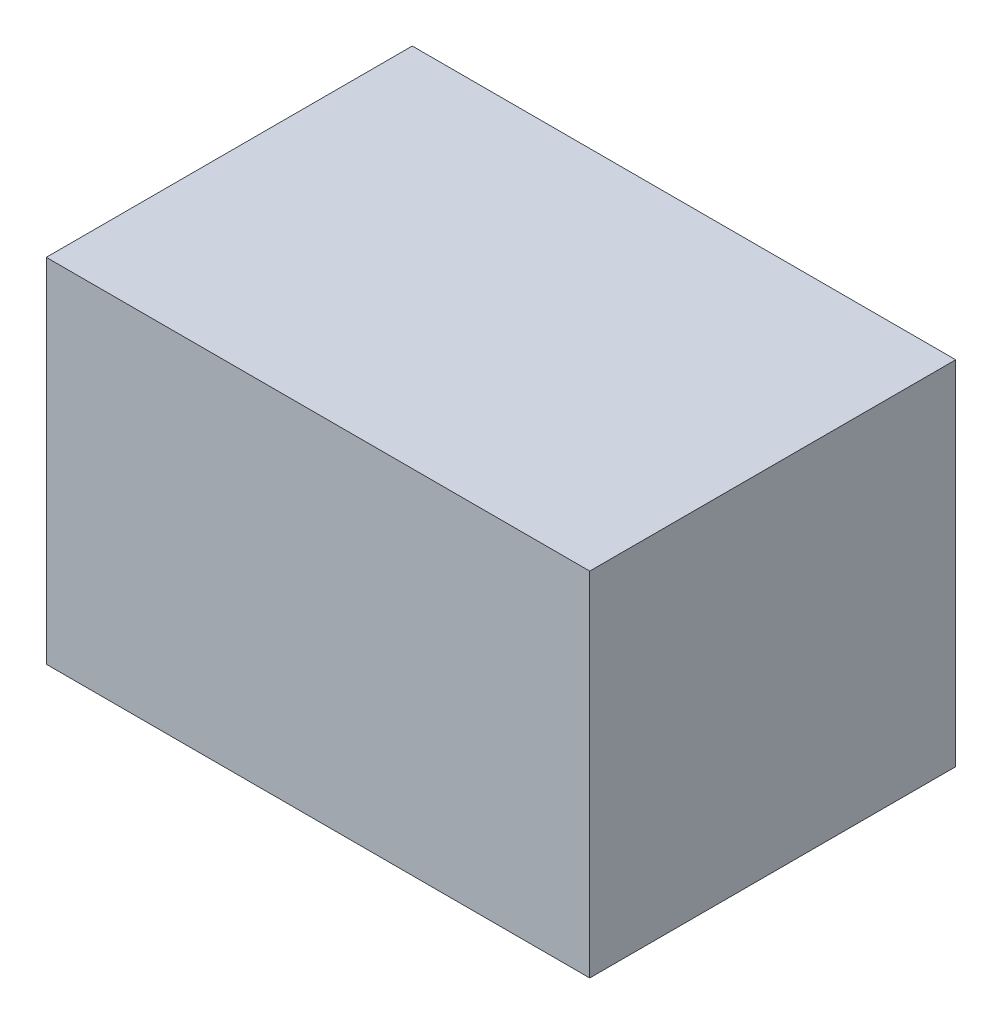
ISO-10303-21;
HEADER;
FILE_DESCRIPTION(('STEP AP214'),'2;1');
FILE_NAME('part.step','',(''),(''),'','','');
FILE_SCHEMA(('AUTOMOTIVE_DESIGN { 1 0 10303 214 1 1 1 1 }'));
ENDSEC;
DATA;
#1=APPLICATION_CONTEXT('core data for automotive mechanical design processes');
#2=APPLICATION_PROTOCOL_DEFINITION('international standard','automotive_design',2000,#1);
#3=PRODUCT_CONTEXT('',#1,'mechanical');
#4=PRODUCT('Part','Part','',(#3));
#5=PRODUCT_RELATED_PRODUCT_CATEGORY('part','',(#4));
#6=PRODUCT_DEFINITION_FORMATION('','',#4);
#7=PRODUCT_DEFINITION_CONTEXT('part definition',#1,'design');
#8=PRODUCT_DEFINITION('design','',#6,#7);
#9=PRODUCT_DEFINITION_SHAPE('','',#8);
#10=(LENGTH_UNIT() NAMED_UNIT(*) SI_UNIT(.MILLI.,.METRE.));
#11=(NAMED_UNIT(*) PLANE_ANGLE_UNIT() SI_UNIT($,.RADIAN.));
#12=(NAMED_UNIT(*) SI_UNIT($,.STERADIAN.) SOLID_ANGLE_UNIT());
#13=UNCERTAINTY_MEASURE_WITH_UNIT(LENGTH_MEASURE(1.E-05),#10,'distance_accuracy_value','');
#14=(GEOMETRIC_REPRESENTATION_CONTEXT(3) GLOBAL_UNCERTAINTY_ASSIGNED_CONTEXT((#13)) GLOBAL_UNIT_ASSIGNED_CONTEXT((#10,
#11,#12)) REPRESENTATION_CONTEXT('',''));
#15=CARTESIAN_POINT('',(0.,0.,0.));
#16=DIRECTION('',(0.,0.,1.));
#17=DIRECTION('',(1.,0.,0.));
#18=AXIS2_PLACEMENT_3D('',#15,#16,#17);
#19=CARTESIAN_POINT('',(0.,0.,80.));
#20=DIRECTION('',(-1.,0.,0.));
#21=DIRECTION('',(0.,0.,1.));
#22=AXIS2_PLACEMENT_3D('',#19,#20,#21);
#23=PLANE('',#22);
#24=DIRECTION('',(0.,1.,0.));
#25=VECTOR('',#24,1.);
#26=CARTESIAN_POINT('',(0.,0.,0.));
#27=LINE('',#26,#25);
#28=CARTESIAN_POINT('',(0.,0.,0.));
#29=VERTEX_POINT('',#28);
#30=CARTESIAN_POINT('',(0.,77.0282636900969,0.));
#31=VERTEX_POINT('',#30);
#32=EDGE_CURVE('E100',#29,#31,#27,.T.);
#33=ORIENTED_EDGE('',*,*,#32,.T.);
#34=DIRECTION('',(0.,0.,-1.));
#35=VECTOR('',#34,1.);
#36=CARTESIAN_POINT('',(0.,77.0282636900969,80.));
#37=LINE('',#36,#35);
#38=CARTESIAN_POINT('',(0.,77.0282636900969,80.));
#39=VERTEX_POINT('',#38);
#40=EDGE_CURVE('E11',#39,#31,#37,.T.);
#41=ORIENTED_EDGE('',*,*,#40,.F.);
#42=DIRECTION('',(0.,1.,0.));
#43=VECTOR('',#42,1.);
#44=CARTESIAN_POINT('',(0.,0.,80.));
#45=LINE('',#44,#43);
#46=CARTESIAN_POINT('',(0.,0.,80.));
#47=VERTEX_POINT('',#46);
#48=EDGE_CURVE('E88',#47,#39,#45,.T.);
#49=ORIENTED_EDGE('',*,*,#48,.F.);
#50=DIRECTION('',(0.,0.,-1.));
#51=VECTOR('',#50,1.);
#52=CARTESIAN_POINT('',(0.,0.,80.));
#53=LINE('',#52,#51);
#54=EDGE_CURVE('E96',#47,#29,#53,.T.);
#55=ORIENTED_EDGE('',*,*,#54,.T.);
#56=EDGE_LOOP('',(#33,#41,#49,#55));
#57=FACE_BOUND('',#56,.T.);
#58=ADVANCED_FACE('F37',(#57),#23,.F.);
#59=CARTESIAN_POINT('',(0.,77.0282636900969,80.));
#60=DIRECTION('',(0.,-1.,0.));
#61=DIRECTION('',(0.,0.,-1.));
#62=AXIS2_PLACEMENT_3D('',#59,#60,#61);
#63=PLANE('',#62);
#64=DIRECTION('',(-1.,0.,0.));
#65=VECTOR('',#64,1.);
#66=CARTESIAN_POINT('',(0.,77.0282636900969,0.));
#67=LINE('',#66,#65);
#68=CARTESIAN_POINT('',(-118.790575329306,77.0282636900969,0.));
#69=VERTEX_POINT('',#68);
#70=EDGE_CURVE('E92',#31,#69,#67,.T.);
#71=ORIENTED_EDGE('',*,*,#70,.T.);
#72=DIRECTION('',(0.,0.,-1.));
#73=VECTOR('',#72,1.);
#74=CARTESIAN_POINT('',(-118.790575329306,77.0282636900969,80.));
#75=LINE('',#74,#73);
#76=CARTESIAN_POINT('',(-118.790575329306,77.0282636900969,80.));
#77=VERTEX_POINT('',#76);
#78=EDGE_CURVE('E45',#77,#69,#75,.T.);
#79=ORIENTED_EDGE('',*,*,#78,.F.);
#80=DIRECTION('',(-1.,0.,0.));
#81=VECTOR('',#80,1.);
#82=CARTESIAN_POINT('',(0.,77.0282636900969,80.));
#83=LINE('',#82,#81);
#84=EDGE_CURVE('E83',#39,#77,#83,.T.);
#85=ORIENTED_EDGE('',*,*,#84,.F.);
#86=ORIENTED_EDGE('',*,*,#40,.T.);
#87=EDGE_LOOP('',(#71,#79,#85,#86));
#88=FACE_BOUND('',#87,.T.);
#89=ADVANCED_FACE('F91',(#88),#63,.F.);
#90=CARTESIAN_POINT('',(-118.790575329306,0.,80.));
#91=DIRECTION('',(1.,0.,0.));
#92=DIRECTION('',(0.,0.,-1.));
#93=AXIS2_PLACEMENT_3D('',#90,#91,#92);
#94=PLANE('',#93);
#95=DIRECTION('',(0.,-1.,0.));
#96=VECTOR('',#95,1.);
#97=CARTESIAN_POINT('',(-118.790575329306,0.,0.));
#98=LINE('',#97,#96);
#99=CARTESIAN_POINT('',(-118.790575329306,0.,0.));
#100=VERTEX_POINT('',#99);
#101=EDGE_CURVE('E70',#69,#100,#98,.T.);
#102=ORIENTED_EDGE('',*,*,#101,.T.);
#103=DIRECTION('',(0.,0.,-1.));
#104=VECTOR('',#103,1.);
#105=CARTESIAN_POINT('',(-118.790575329306,0.,80.));
#106=LINE('',#105,#104);
#107=CARTESIAN_POINT('',(-118.790575329306,0.,80.));
#108=VERTEX_POINT('',#107);
#109=EDGE_CURVE('E93',#108,#100,#106,.T.);
#110=ORIENTED_EDGE('',*,*,#109,.F.);
#111=DIRECTION('',(0.,-1.,0.));
#112=VECTOR('',#111,1.);
#113=CARTESIAN_POINT('',(-118.790575329306,0.,80.));
#114=LINE('',#113,#112);
#115=EDGE_CURVE('E86',#77,#108,#114,.T.);
#116=ORIENTED_EDGE('',*,*,#115,.F.);
#117=ORIENTED_EDGE('',*,*,#78,.T.);
#118=EDGE_LOOP('',(#102,#110,#116,#117));
#119=FACE_BOUND('',#118,.T.);
#120=ADVANCED_FACE('F94',(#119),#94,.F.);
#121=CARTESIAN_POINT('',(0.,0.,80.));
#122=DIRECTION('',(0.,1.,0.));
#123=DIRECTION('',(0.,0.,1.));
#124=AXIS2_PLACEMENT_3D('',#121,#122,#123);
#125=PLANE('',#124);
#126=DIRECTION('',(1.,0.,0.));
#127=VECTOR('',#126,1.);
#128=CARTESIAN_POINT('',(0.,0.,0.));
#129=LINE('',#128,#127);
#130=EDGE_CURVE('E76',#100,#29,#129,.T.);
#131=ORIENTED_EDGE('',*,*,#130,.T.);
#132=ORIENTED_EDGE('',*,*,#54,.F.);
#133=DIRECTION('',(1.,0.,0.));
#134=VECTOR('',#133,1.);
#135=CARTESIAN_POINT('',(0.,0.,80.));
#136=LINE('',#135,#134);
#137=EDGE_CURVE('E53',#108,#47,#136,.T.);
#138=ORIENTED_EDGE('',*,*,#137,.F.);
#139=ORIENTED_EDGE('',*,*,#109,.T.);
#140=EDGE_LOOP('',(#131,#132,#138,#139));
#141=FACE_BOUND('',#140,.T.);
#142=ADVANCED_FACE('F107',(#141),#125,.F.);
#143=CARTESIAN_POINT('',(0.,0.,80.));
#144=DIRECTION('',(0.,0.,1.));
#145=DIRECTION('',(1.,0.,0.));
#146=AXIS2_PLACEMENT_3D('',#143,#144,#145);
#147=PLANE('',#146);
#148=ORIENTED_EDGE('',*,*,#48,.T.);
#149=ORIENTED_EDGE('',*,*,#84,.T.);
#150=ORIENTED_EDGE('',*,*,#115,.T.);
#151=ORIENTED_EDGE('',*,*,#137,.T.);
#152=EDGE_LOOP('',(#148,#149,#150,#151));
#153=FACE_BOUND('',#152,.T.);
#154=ADVANCED_FACE('F84',(#153),#147,.T.);
#155=CARTESIAN_POINT('',(0.,0.,0.));
#156=DIRECTION('',(0.,0.,1.));
#157=DIRECTION('',(1.,0.,0.));
#158=AXIS2_PLACEMENT_3D('',#155,#156,#157);
#159=PLANE('',#158);
#160=ORIENTED_EDGE('',*,*,#32,.F.);
#161=ORIENTED_EDGE('',*,*,#130,.F.);
#162=ORIENTED_EDGE('',*,*,#101,.F.);
#163=ORIENTED_EDGE('',*,*,#70,.F.);
#164=EDGE_LOOP('',(#160,#161,#162,#163));
#165=FACE_BOUND('',#164,.T.);
#166=ADVANCED_FACE('F110',(#165),#159,.F.);
#167=CLOSED_SHELL('',(#58,#89,#120,#142,#154,#166));
#168=MANIFOLD_SOLID_BREP('B2',#167);
#169=ADVANCED_BREP_SHAPE_REPRESENTATION('',(#18,#168),#14);
#170=SHAPE_DEFINITION_REPRESENTATION(#9,#169);
ENDSEC;
END-ISO-10303-21;
